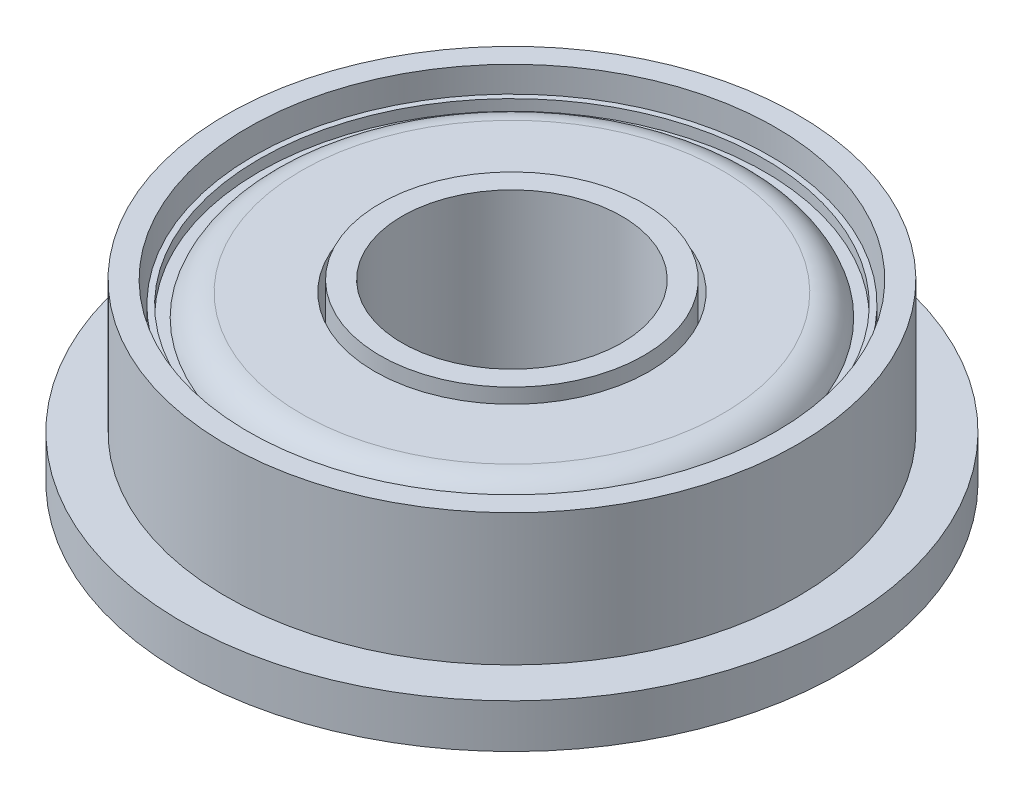
ISO-10303-21;
HEADER;
FILE_DESCRIPTION(('STEP AP214'),'2;1');
FILE_NAME('part.step','',(''),(''),'','','');
FILE_SCHEMA(('AUTOMOTIVE_DESIGN { 1 0 10303 214 1 1 1 1 }'));
ENDSEC;
DATA;
#1=APPLICATION_CONTEXT('core data for automotive mechanical design processes');
#2=APPLICATION_PROTOCOL_DEFINITION('international standard','automotive_design',2000,#1);
#3=PRODUCT_CONTEXT('',#1,'mechanical');
#4=PRODUCT('Part','Part','',(#3));
#5=PRODUCT_RELATED_PRODUCT_CATEGORY('part','',(#4));
#6=PRODUCT_DEFINITION_FORMATION('','',#4);
#7=PRODUCT_DEFINITION_CONTEXT('part definition',#1,'design');
#8=PRODUCT_DEFINITION('design','',#6,#7);
#9=PRODUCT_DEFINITION_SHAPE('','',#8);
#10=(LENGTH_UNIT() NAMED_UNIT(*) SI_UNIT(.MILLI.,.METRE.));
#11=(NAMED_UNIT(*) PLANE_ANGLE_UNIT() SI_UNIT($,.RADIAN.));
#12=(NAMED_UNIT(*) SI_UNIT($,.STERADIAN.) SOLID_ANGLE_UNIT());
#13=UNCERTAINTY_MEASURE_WITH_UNIT(LENGTH_MEASURE(1.E-05),#10,'distance_accuracy_value','');
#14=(GEOMETRIC_REPRESENTATION_CONTEXT(3) GLOBAL_UNCERTAINTY_ASSIGNED_CONTEXT((#13)) GLOBAL_UNIT_ASSIGNED_CONTEXT((#10,
#11,#12)) REPRESENTATION_CONTEXT('',''));
#15=CARTESIAN_POINT('',(0.,0.,0.));
#16=DIRECTION('',(0.,0.,1.));
#17=DIRECTION('',(1.,0.,0.));
#18=AXIS2_PLACEMENT_3D('',#15,#16,#17);
#19=CARTESIAN_POINT('',(0.,0.,0.));
#20=DIRECTION('',(0.,1.,0.));
#21=DIRECTION('',(1.,0.,0.));
#22=AXIS2_PLACEMENT_3D('',#19,#20,#21);
#23=PLANE('',#22);
#24=CARTESIAN_POINT('',(0.,0.,0.));
#25=DIRECTION('',(0.,-1.,0.));
#26=DIRECTION('',(1.,0.,0.));
#27=AXIS2_PLACEMENT_3D('',#24,#25,#26);
#28=CIRCLE('',#27,2.5);
#29=CARTESIAN_POINT('',(-2.5,0.,0.));
#30=VERTEX_POINT('',#29);
#31=EDGE_CURVE('E187',#30,#30,#28,.T.);
#32=ORIENTED_EDGE('',*,*,#31,.F.);
#33=EDGE_LOOP('',(#32));
#34=FACE_BOUND('',#33,.T.);
#35=CARTESIAN_POINT('',(0.,0.,0.));
#36=DIRECTION('',(0.,-1.,0.));
#37=DIRECTION('',(1.,0.,0.));
#38=AXIS2_PLACEMENT_3D('',#35,#36,#37);
#39=CIRCLE('',#38,3.00000004470348);
#40=CARTESIAN_POINT('',(-3.00000004470348,0.,0.));
#41=VERTEX_POINT('',#40);
#42=EDGE_CURVE('E136',#41,#41,#39,.T.);
#43=ORIENTED_EDGE('',*,*,#42,.T.);
#44=EDGE_LOOP('',(#43));
#45=FACE_BOUND('',#44,.T.);
#46=ADVANCED_FACE('F16',(#34,#45),#23,.F.);
#47=CARTESIAN_POINT('',(0.,1.,0.));
#48=DIRECTION('',(0.,1.,0.));
#49=DIRECTION('',(1.,0.,0.));
#50=AXIS2_PLACEMENT_3D('',#47,#48,#49);
#51=PLANE('',#50);
#52=CARTESIAN_POINT('',(0.,1.,0.));
#53=DIRECTION('',(0.,-1.,0.));
#54=DIRECTION('',(-1.,0.,0.));
#55=AXIS2_PLACEMENT_3D('',#52,#53,#54);
#56=CIRCLE('',#55,6.5);
#57=CARTESIAN_POINT('',(6.5,1.,0.));
#58=VERTEX_POINT('',#57);
#59=EDGE_CURVE('E168',#58,#58,#56,.T.);
#60=ORIENTED_EDGE('',*,*,#59,.T.);
#61=EDGE_LOOP('',(#60));
#62=FACE_BOUND('',#61,.T.);
#63=CARTESIAN_POINT('',(0.,1.,0.));
#64=DIRECTION('',(0.,1.,0.));
#65=DIRECTION('',(1.,0.,0.));
#66=AXIS2_PLACEMENT_3D('',#63,#64,#65);
#67=CIRCLE('',#66,7.5);
#68=CARTESIAN_POINT('',(-7.5,1.,0.));
#69=VERTEX_POINT('',#68);
#70=EDGE_CURVE('E27',#69,#69,#67,.T.);
#71=ORIENTED_EDGE('',*,*,#70,.T.);
#72=EDGE_LOOP('',(#71));
#73=FACE_BOUND('',#72,.T.);
#74=ADVANCED_FACE('F269',(#62,#73),#51,.T.);
#75=CARTESIAN_POINT('',(0.,0.,0.));
#76=DIRECTION('',(0.,1.,0.));
#77=DIRECTION('',(1.,0.,0.));
#78=AXIS2_PLACEMENT_3D('',#75,#76,#77);
#79=CYLINDRICAL_SURFACE('',#78,7.5);
#80=ORIENTED_EDGE('',*,*,#70,.F.);
#81=DIRECTION('',(0.,-1.,0.));
#82=VECTOR('',#81,1.);
#83=CARTESIAN_POINT('',(-7.5,0.,0.));
#84=LINE('',#83,#82);
#85=CARTESIAN_POINT('',(-7.5,0.,0.));
#86=VERTEX_POINT('',#85);
#87=EDGE_CURVE('E11',#69,#86,#84,.T.);
#88=ORIENTED_EDGE('',*,*,#87,.T.);
#89=CARTESIAN_POINT('',(0.,0.,0.));
#90=DIRECTION('',(0.,1.,0.));
#91=DIRECTION('',(1.,0.,0.));
#92=AXIS2_PLACEMENT_3D('',#89,#90,#91);
#93=CIRCLE('',#92,7.5);
#94=EDGE_CURVE('E163',#86,#86,#93,.T.);
#95=ORIENTED_EDGE('',*,*,#94,.T.);
#96=ORIENTED_EDGE('',*,*,#87,.F.);
#97=EDGE_LOOP('',(#80,#88,#95,#96));
#98=FACE_BOUND('',#97,.T.);
#99=ADVANCED_FACE('F18',(#98),#79,.T.);
#100=CARTESIAN_POINT('',(0.,0.,0.));
#101=DIRECTION('',(0.,1.,0.));
#102=DIRECTION('',(1.,0.,0.));
#103=AXIS2_PLACEMENT_3D('',#100,#101,#102);
#104=CYLINDRICAL_SURFACE('',#103,2.5);
#105=CARTESIAN_POINT('',(0.,4.,0.));
#106=DIRECTION('',(0.,-1.,0.));
#107=DIRECTION('',(-1.,0.,0.));
#108=AXIS2_PLACEMENT_3D('',#105,#106,#107);
#109=CIRCLE('',#108,2.5);
#110=CARTESIAN_POINT('',(2.5,4.,0.));
#111=VERTEX_POINT('',#110);
#112=CARTESIAN_POINT('',(-2.5,4.,0.));
#113=VERTEX_POINT('',#112);
#114=EDGE_CURVE('E233',#111,#113,#109,.T.);
#115=ORIENTED_EDGE('',*,*,#114,.F.);
#116=CARTESIAN_POINT('',(0.,4.,0.));
#117=DIRECTION('',(0.,-1.,0.));
#118=DIRECTION('',(-1.,0.,0.));
#119=AXIS2_PLACEMENT_3D('',#116,#117,#118);
#120=CIRCLE('',#119,2.5);
#121=EDGE_CURVE('E250',#113,#111,#120,.T.);
#122=ORIENTED_EDGE('',*,*,#121,.F.);
#123=DIRECTION('',(0.,-1.,0.));
#124=VECTOR('',#123,1.);
#125=CARTESIAN_POINT('',(-2.5,0.,0.));
#126=LINE('',#125,#124);
#127=EDGE_CURVE('E190',#113,#30,#126,.T.);
#128=ORIENTED_EDGE('',*,*,#127,.T.);
#129=ORIENTED_EDGE('',*,*,#31,.T.);
#130=ORIENTED_EDGE('',*,*,#127,.F.);
#131=EDGE_LOOP('',(#115,#122,#128,#129,#130));
#132=FACE_BOUND('',#131,.T.);
#133=ADVANCED_FACE('F265',(#132),#104,.F.);
#134=CARTESIAN_POINT('',(0.,4.,0.));
#135=DIRECTION('',(0.,1.,0.));
#136=DIRECTION('',(1.,0.,0.));
#137=AXIS2_PLACEMENT_3D('',#134,#135,#136);
#138=PLANE('',#137);
#139=ORIENTED_EDGE('',*,*,#114,.T.);
#140=ORIENTED_EDGE('',*,*,#121,.T.);
#141=EDGE_LOOP('',(#139,#140));
#142=FACE_BOUND('',#141,.T.);
#143=CARTESIAN_POINT('',(0.,4.,0.));
#144=DIRECTION('',(0.,1.,0.));
#145=DIRECTION('',(-1.,0.,0.));
#146=AXIS2_PLACEMENT_3D('',#143,#144,#145);
#147=CIRCLE('',#146,3.00000004470348);
#148=CARTESIAN_POINT('',(3.00000004470348,4.,0.));
#149=VERTEX_POINT('',#148);
#150=EDGE_CURVE('E175',#149,#149,#147,.T.);
#151=ORIENTED_EDGE('',*,*,#150,.T.);
#152=EDGE_LOOP('',(#151));
#153=FACE_BOUND('',#152,.T.);
#154=ADVANCED_FACE('F262',(#142,#153),#138,.T.);
#155=CARTESIAN_POINT('',(0.,1.,0.));
#156=DIRECTION('',(0.,1.,0.));
#157=DIRECTION('',(-1.,0.,0.));
#158=AXIS2_PLACEMENT_3D('',#155,#156,#157);
#159=CYLINDRICAL_SURFACE('',#158,6.5);
#160=CARTESIAN_POINT('',(0.,4.,0.));
#161=DIRECTION('',(0.,1.,0.));
#162=DIRECTION('',(-1.,0.,0.));
#163=AXIS2_PLACEMENT_3D('',#160,#161,#162);
#164=CIRCLE('',#163,6.5);
#165=CARTESIAN_POINT('',(6.5,4.,0.));
#166=VERTEX_POINT('',#165);
#167=EDGE_CURVE('E169',#166,#166,#164,.T.);
#168=ORIENTED_EDGE('',*,*,#167,.F.);
#169=DIRECTION('',(0.,-1.,0.));
#170=VECTOR('',#169,1.);
#171=CARTESIAN_POINT('',(6.5,1.,0.));
#172=LINE('',#171,#170);
#173=EDGE_CURVE('E164',#166,#58,#172,.T.);
#174=ORIENTED_EDGE('',*,*,#173,.T.);
#175=ORIENTED_EDGE('',*,*,#59,.F.);
#176=ORIENTED_EDGE('',*,*,#173,.F.);
#177=EDGE_LOOP('',(#168,#174,#175,#176));
#178=FACE_BOUND('',#177,.T.);
#179=ADVANCED_FACE('F288',(#178),#159,.T.);
#180=CARTESIAN_POINT('',(0.,4.,0.));
#181=DIRECTION('',(0.,1.,0.));
#182=DIRECTION('',(1.,0.,0.));
#183=AXIS2_PLACEMENT_3D('',#180,#181,#182);
#184=PLANE('',#183);
#185=CARTESIAN_POINT('',(0.,4.,0.));
#186=DIRECTION('',(0.,-1.,0.));
#187=DIRECTION('',(-1.,0.,0.));
#188=AXIS2_PLACEMENT_3D('',#185,#186,#187);
#189=CIRCLE('',#188,6.);
#190=CARTESIAN_POINT('',(6.,4.,0.));
#191=VERTEX_POINT('',#190);
#192=EDGE_CURVE('E153',#191,#191,#189,.T.);
#193=ORIENTED_EDGE('',*,*,#192,.T.);
#194=EDGE_LOOP('',(#193));
#195=FACE_BOUND('',#194,.T.);
#196=ORIENTED_EDGE('',*,*,#167,.T.);
#197=EDGE_LOOP('',(#196));
#198=FACE_BOUND('',#197,.T.);
#199=ADVANCED_FACE('F295',(#195,#198),#184,.T.);
#200=CARTESIAN_POINT('',(0.,1.,0.));
#201=DIRECTION('',(0.,1.,0.));
#202=DIRECTION('',(1.,0.,0.));
#203=AXIS2_PLACEMENT_3D('',#200,#201,#202);
#204=PLANE('',#203);
#205=CARTESIAN_POINT('',(0.,1.,0.));
#206=DIRECTION('',(0.,1.,0.));
#207=DIRECTION('',(-1.,0.,0.));
#208=AXIS2_PLACEMENT_3D('',#205,#206,#207);
#209=CIRCLE('',#208,5.875);
#210=CARTESIAN_POINT('',(5.875,1.,0.));
#211=VERTEX_POINT('',#210);
#212=EDGE_CURVE('E150',#211,#211,#209,.T.);
#213=ORIENTED_EDGE('',*,*,#212,.F.);
#214=EDGE_LOOP('',(#213));
#215=FACE_BOUND('',#214,.T.);
#216=CARTESIAN_POINT('',(0.,1.,0.));
#217=DIRECTION('',(0.,-1.,0.));
#218=DIRECTION('',(-1.,0.,0.));
#219=AXIS2_PLACEMENT_3D('',#216,#217,#218);
#220=CIRCLE('',#219,6.);
#221=CARTESIAN_POINT('',(6.,1.,0.));
#222=VERTEX_POINT('',#221);
#223=EDGE_CURVE('E20',#222,#222,#220,.T.);
#224=ORIENTED_EDGE('',*,*,#223,.F.);
#225=EDGE_LOOP('',(#224));
#226=FACE_BOUND('',#225,.T.);
#227=ADVANCED_FACE('F298',(#215,#226),#204,.T.);
#228=CARTESIAN_POINT('',(0.,4.,0.));
#229=DIRECTION('',(0.,-1.,0.));
#230=DIRECTION('',(-1.,0.,0.));
#231=AXIS2_PLACEMENT_3D('',#228,#229,#230);
#232=CYLINDRICAL_SURFACE('',#231,6.);
#233=ORIENTED_EDGE('',*,*,#192,.F.);
#234=DIRECTION('',(0.,-1.,0.));
#235=VECTOR('',#234,1.);
#236=CARTESIAN_POINT('',(6.,4.,0.));
#237=LINE('',#236,#235);
#238=EDGE_CURVE('E106',#191,#222,#237,.T.);
#239=ORIENTED_EDGE('',*,*,#238,.T.);
#240=ORIENTED_EDGE('',*,*,#223,.T.);
#241=ORIENTED_EDGE('',*,*,#238,.F.);
#242=EDGE_LOOP('',(#233,#239,#240,#241));
#243=FACE_BOUND('',#242,.T.);
#244=ADVANCED_FACE('F329',(#243),#232,.F.);
#245=CARTESIAN_POINT('',(0.,4.,0.));
#246=DIRECTION('',(0.,-1.,0.));
#247=DIRECTION('',(-1.,0.,0.));
#248=AXIS2_PLACEMENT_3D('',#245,#246,#247);
#249=CYLINDRICAL_SURFACE('',#248,5.875);
#250=CARTESIAN_POINT('',(0.,3.5,0.));
#251=DIRECTION('',(0.,-1.,0.));
#252=DIRECTION('',(-1.,0.,0.));
#253=AXIS2_PLACEMENT_3D('',#250,#251,#252);
#254=CIRCLE('',#253,5.875);
#255=CARTESIAN_POINT('',(5.875,3.5,0.));
#256=VERTEX_POINT('',#255);
#257=EDGE_CURVE('E179',#256,#256,#254,.T.);
#258=ORIENTED_EDGE('',*,*,#257,.T.);
#259=DIRECTION('',(0.,-1.,0.));
#260=VECTOR('',#259,1.);
#261=CARTESIAN_POINT('',(5.875,4.,0.));
#262=LINE('',#261,#260);
#263=EDGE_CURVE('E154',#256,#211,#262,.T.);
#264=ORIENTED_EDGE('',*,*,#263,.T.);
#265=ORIENTED_EDGE('',*,*,#212,.T.);
#266=ORIENTED_EDGE('',*,*,#263,.F.);
#267=EDGE_LOOP('',(#258,#264,#265,#266));
#268=FACE_BOUND('',#267,.T.);
#269=ADVANCED_FACE('F324',(#268),#249,.T.);
#270=CARTESIAN_POINT('',(0.,1.,0.));
#271=DIRECTION('',(0.,1.,0.));
#272=DIRECTION('',(1.,0.,0.));
#273=AXIS2_PLACEMENT_3D('',#270,#271,#272);
#274=PLANE('',#273);
#275=CARTESIAN_POINT('',(0.,1.,0.));
#276=DIRECTION('',(0.,1.,0.));
#277=DIRECTION('',(-1.,0.,0.));
#278=AXIS2_PLACEMENT_3D('',#275,#276,#277);
#279=CIRCLE('',#278,3.00000004470348);
#280=CARTESIAN_POINT('',(3.00000004470348,1.,0.));
#281=VERTEX_POINT('',#280);
#282=EDGE_CURVE('E174',#281,#281,#279,.T.);
#283=ORIENTED_EDGE('',*,*,#282,.F.);
#284=EDGE_LOOP('',(#283));
#285=FACE_BOUND('',#284,.T.);
#286=CARTESIAN_POINT('',(0.,1.,0.));
#287=DIRECTION('',(0.,-1.,0.));
#288=DIRECTION('',(-1.,0.,0.));
#289=AXIS2_PLACEMENT_3D('',#286,#287,#288);
#290=CIRCLE('',#289,3.125);
#291=CARTESIAN_POINT('',(3.125,1.,0.));
#292=VERTEX_POINT('',#291);
#293=EDGE_CURVE('E240',#292,#292,#290,.T.);
#294=ORIENTED_EDGE('',*,*,#293,.F.);
#295=EDGE_LOOP('',(#294));
#296=FACE_BOUND('',#295,.T.);
#297=ADVANCED_FACE('F279',(#285,#296),#274,.T.);
#298=CARTESIAN_POINT('',(0.,4.,0.));
#299=DIRECTION('',(0.,-1.,0.));
#300=DIRECTION('',(-1.,0.,0.));
#301=AXIS2_PLACEMENT_3D('',#298,#299,#300);
#302=CYLINDRICAL_SURFACE('',#301,3.125);
#303=CARTESIAN_POINT('',(0.,3.75,0.));
#304=DIRECTION('',(0.,1.,0.));
#305=DIRECTION('',(-1.,0.,0.));
#306=AXIS2_PLACEMENT_3D('',#303,#304,#305);
#307=CIRCLE('',#306,3.125);
#308=CARTESIAN_POINT('',(3.125,3.75,0.));
#309=VERTEX_POINT('',#308);
#310=EDGE_CURVE('E212',#309,#309,#307,.T.);
#311=ORIENTED_EDGE('',*,*,#310,.T.);
#312=DIRECTION('',(0.,-1.,0.));
#313=VECTOR('',#312,1.);
#314=CARTESIAN_POINT('',(3.125,4.,0.));
#315=LINE('',#314,#313);
#316=EDGE_CURVE('E205',#309,#292,#315,.T.);
#317=ORIENTED_EDGE('',*,*,#316,.T.);
#318=ORIENTED_EDGE('',*,*,#293,.T.);
#319=ORIENTED_EDGE('',*,*,#316,.F.);
#320=EDGE_LOOP('',(#311,#317,#318,#319));
#321=FACE_BOUND('',#320,.T.);
#322=ADVANCED_FACE('F317',(#321),#302,.F.);
#323=CARTESIAN_POINT('',(0.,4.,0.));
#324=DIRECTION('',(0.,-1.,0.));
#325=DIRECTION('',(-1.,0.,0.));
#326=AXIS2_PLACEMENT_3D('',#323,#324,#325);
#327=CYLINDRICAL_SURFACE('',#326,3.00000004470348);
#328=ORIENTED_EDGE('',*,*,#150,.F.);
#329=DIRECTION('',(0.,-1.,0.));
#330=VECTOR('',#329,1.);
#331=CARTESIAN_POINT('',(3.00000004470348,4.,0.));
#332=LINE('',#331,#330);
#333=EDGE_CURVE('E170',#149,#281,#332,.T.);
#334=ORIENTED_EDGE('',*,*,#333,.T.);
#335=ORIENTED_EDGE('',*,*,#282,.T.);
#336=ORIENTED_EDGE('',*,*,#333,.F.);
#337=EDGE_LOOP('',(#328,#334,#335,#336));
#338=FACE_BOUND('',#337,.T.);
#339=ADVANCED_FACE('F309',(#338),#327,.T.);
#340=CARTESIAN_POINT('',(0.,3.5,0.));
#341=DIRECTION('',(0.,1.,0.));
#342=DIRECTION('',(1.,0.,0.));
#343=AXIS2_PLACEMENT_3D('',#340,#341,#342);
#344=PLANE('',#343);
#345=CARTESIAN_POINT('',(0.,3.5,0.));
#346=DIRECTION('',(0.,1.,0.));
#347=DIRECTION('',(-1.,0.,0.));
#348=AXIS2_PLACEMENT_3D('',#345,#346,#347);
#349=CIRCLE('',#348,5.75);
#350=CARTESIAN_POINT('',(5.75,3.5,0.));
#351=VERTEX_POINT('',#350);
#352=EDGE_CURVE('E198',#351,#351,#349,.T.);
#353=ORIENTED_EDGE('',*,*,#352,.F.);
#354=EDGE_LOOP('',(#353));
#355=FACE_BOUND('',#354,.T.);
#356=ORIENTED_EDGE('',*,*,#257,.F.);
#357=EDGE_LOOP('',(#356));
#358=FACE_BOUND('',#357,.T.);
#359=ADVANCED_FACE('F307',(#355,#358),#344,.T.);
#360=CARTESIAN_POINT('',(0.,3.25,0.));
#361=DIRECTION('',(0.,1.,0.));
#362=DIRECTION('',(1.,0.,0.));
#363=AXIS2_PLACEMENT_3D('',#360,#361,#362);
#364=PLANE('',#363);
#365=CARTESIAN_POINT('',(0.,3.25,0.));
#366=DIRECTION('',(0.,1.,0.));
#367=DIRECTION('',(-1.,0.,0.));
#368=AXIS2_PLACEMENT_3D('',#365,#366,#367);
#369=CIRCLE('',#368,5.5);
#370=CARTESIAN_POINT('',(-5.5,3.25,0.));
#371=VERTEX_POINT('',#370);
#372=EDGE_CURVE('E202',#371,#371,#369,.T.);
#373=ORIENTED_EDGE('',*,*,#372,.F.);
#374=EDGE_LOOP('',(#373));
#375=FACE_BOUND('',#374,.T.);
#376=CARTESIAN_POINT('',(0.,3.25,0.));
#377=DIRECTION('',(0.,-1.,0.));
#378=DIRECTION('',(-1.,0.,0.));
#379=AXIS2_PLACEMENT_3D('',#376,#377,#378);
#380=CIRCLE('',#379,5.75);
#381=CARTESIAN_POINT('',(5.75,3.25,0.));
#382=VERTEX_POINT('',#381);
#383=EDGE_CURVE('E176',#382,#382,#380,.T.);
#384=ORIENTED_EDGE('',*,*,#383,.F.);
#385=EDGE_LOOP('',(#384));
#386=FACE_BOUND('',#385,.T.);
#387=ADVANCED_FACE('F305',(#375,#386),#364,.T.);
#388=CARTESIAN_POINT('',(0.,4.,0.));
#389=DIRECTION('',(0.,-1.,0.));
#390=DIRECTION('',(-1.,0.,0.));
#391=AXIS2_PLACEMENT_3D('',#388,#389,#390);
#392=CYLINDRICAL_SURFACE('',#391,5.75);
#393=ORIENTED_EDGE('',*,*,#352,.T.);
#394=DIRECTION('',(0.,-1.,0.));
#395=VECTOR('',#394,1.);
#396=CARTESIAN_POINT('',(5.75,4.,0.));
#397=LINE('',#396,#395);
#398=EDGE_CURVE('E180',#351,#382,#397,.T.);
#399=ORIENTED_EDGE('',*,*,#398,.T.);
#400=ORIENTED_EDGE('',*,*,#383,.T.);
#401=ORIENTED_EDGE('',*,*,#398,.F.);
#402=EDGE_LOOP('',(#393,#399,#400,#401));
#403=FACE_BOUND('',#402,.T.);
#404=ADVANCED_FACE('F293',(#403),#392,.F.);
#405=CARTESIAN_POINT('',(0.,3.75,0.));
#406=DIRECTION('',(0.,1.,0.));
#407=DIRECTION('',(1.,0.,0.));
#408=AXIS2_PLACEMENT_3D('',#405,#406,#407);
#409=PLANE('',#408);
#410=ORIENTED_EDGE('',*,*,#310,.F.);
#411=EDGE_LOOP('',(#410));
#412=FACE_BOUND('',#411,.T.);
#413=CARTESIAN_POINT('',(0.,3.75,0.));
#414=DIRECTION('',(0.,-1.,0.));
#415=DIRECTION('',(1.,0.,0.));
#416=AXIS2_PLACEMENT_3D('',#413,#414,#415);
#417=CIRCLE('',#416,4.79289321881345);
#418=CARTESIAN_POINT('',(-4.79289321881345,3.75,0.));
#419=VERTEX_POINT('',#418);
#420=EDGE_CURVE('E186',#419,#419,#417,.T.);
#421=ORIENTED_EDGE('',*,*,#420,.F.);
#422=EDGE_LOOP('',(#421));
#423=FACE_BOUND('',#422,.T.);
#424=ADVANCED_FACE('F289',(#412,#423),#409,.T.);
#425=CARTESIAN_POINT('',(0.,3.,0.));
#426=DIRECTION('',(0.,1.,0.));
#427=DIRECTION('',(1.,0.,0.));
#428=AXIS2_PLACEMENT_3D('',#425,#426,#427);
#429=TOROIDAL_SURFACE('',#428,4.79289321881345,0.75);
#430=ORIENTED_EDGE('',*,*,#420,.T.);
#431=CARTESIAN_POINT('',(-4.79289321881345,3.,0.));
#432=DIRECTION('',(0.,0.,1.));
#433=DIRECTION('',(-1.,0.,0.));
#434=AXIS2_PLACEMENT_3D('',#431,#432,#433);
#435=CIRCLE('',#434,0.75);
#436=EDGE_CURVE('E194',#419,#371,#435,.T.);
#437=ORIENTED_EDGE('',*,*,#436,.T.);
#438=ORIENTED_EDGE('',*,*,#372,.T.);
#439=ORIENTED_EDGE('',*,*,#436,.F.);
#440=EDGE_LOOP('',(#430,#437,#438,#439));
#441=FACE_BOUND('',#440,.T.);
#442=ADVANCED_FACE('F292',(#441),#429,.T.);
#443=CARTESIAN_POINT('',(0.,0.,0.));
#444=DIRECTION('',(0.,1.,0.));
#445=DIRECTION('',(1.,0.,0.));
#446=AXIS2_PLACEMENT_3D('',#443,#444,#445);
#447=PLANE('',#446);
#448=CARTESIAN_POINT('',(0.,0.,0.));
#449=DIRECTION('',(0.,1.,0.));
#450=DIRECTION('',(1.,0.,0.));
#451=AXIS2_PLACEMENT_3D('',#448,#449,#450);
#452=CIRCLE('',#451,6.);
#453=CARTESIAN_POINT('',(-6.,0.,0.));
#454=VERTEX_POINT('',#453);
#455=EDGE_CURVE('E160',#454,#454,#452,.T.);
#456=ORIENTED_EDGE('',*,*,#455,.T.);
#457=EDGE_LOOP('',(#456));
#458=FACE_BOUND('',#457,.T.);
#459=ORIENTED_EDGE('',*,*,#94,.F.);
#460=EDGE_LOOP('',(#459));
#461=FACE_BOUND('',#460,.T.);
#462=ADVANCED_FACE('F302',(#458,#461),#447,.F.);
#463=CARTESIAN_POINT('',(0.,0.25,0.));
#464=DIRECTION('',(0.,-1.,0.));
#465=DIRECTION('',(0.,0.,-1.));
#466=AXIS2_PLACEMENT_3D('',#463,#464,#465);
#467=PLANE('',#466);
#468=CARTESIAN_POINT('',(0.,0.25,0.));
#469=DIRECTION('',(0.,-1.,0.));
#470=DIRECTION('',(1.,0.,0.));
#471=AXIS2_PLACEMENT_3D('',#468,#469,#470);
#472=CIRCLE('',#471,3.00000004470348);
#473=CARTESIAN_POINT('',(-3.00000004470348,0.25,0.));
#474=VERTEX_POINT('',#473);
#475=EDGE_CURVE('E138',#474,#474,#472,.T.);
#476=ORIENTED_EDGE('',*,*,#475,.F.);
#477=EDGE_LOOP('',(#476));
#478=FACE_BOUND('',#477,.T.);
#479=CARTESIAN_POINT('',(0.,0.25,0.));
#480=DIRECTION('',(0.,1.,0.));
#481=DIRECTION('',(1.,0.,0.));
#482=AXIS2_PLACEMENT_3D('',#479,#480,#481);
#483=CIRCLE('',#482,6.);
#484=CARTESIAN_POINT('',(-6.,0.25,0.));
#485=VERTEX_POINT('',#484);
#486=EDGE_CURVE('E159',#485,#485,#483,.T.);
#487=ORIENTED_EDGE('',*,*,#486,.F.);
#488=EDGE_LOOP('',(#487));
#489=FACE_BOUND('',#488,.T.);
#490=ADVANCED_FACE('F284',(#478,#489),#467,.T.);
#491=CARTESIAN_POINT('',(0.,0.,0.));
#492=DIRECTION('',(0.,1.,0.));
#493=DIRECTION('',(1.,0.,0.));
#494=AXIS2_PLACEMENT_3D('',#491,#492,#493);
#495=CYLINDRICAL_SURFACE('',#494,6.);
#496=ORIENTED_EDGE('',*,*,#455,.F.);
#497=DIRECTION('',(0.,1.,0.));
#498=VECTOR('',#497,1.);
#499=CARTESIAN_POINT('',(-6.,0.,0.));
#500=LINE('',#499,#498);
#501=EDGE_CURVE('E155',#454,#485,#500,.T.);
#502=ORIENTED_EDGE('',*,*,#501,.T.);
#503=ORIENTED_EDGE('',*,*,#486,.T.);
#504=ORIENTED_EDGE('',*,*,#501,.F.);
#505=EDGE_LOOP('',(#496,#502,#503,#504));
#506=FACE_BOUND('',#505,.T.);
#507=ADVANCED_FACE('F281',(#506),#495,.F.);
#508=CARTESIAN_POINT('',(0.,0.,0.));
#509=DIRECTION('',(0.,1.,0.));
#510=DIRECTION('',(1.,0.,0.));
#511=AXIS2_PLACEMENT_3D('',#508,#509,#510);
#512=CYLINDRICAL_SURFACE('',#511,3.00000004470348);
#513=ORIENTED_EDGE('',*,*,#42,.F.);
#514=DIRECTION('',(0.,1.,0.));
#515=VECTOR('',#514,1.);
#516=CARTESIAN_POINT('',(-3.00000004470348,0.,0.));
#517=LINE('',#516,#515);
#518=EDGE_CURVE('E133',#41,#474,#517,.T.);
#519=ORIENTED_EDGE('',*,*,#518,.T.);
#520=ORIENTED_EDGE('',*,*,#475,.T.);
#521=ORIENTED_EDGE('',*,*,#518,.F.);
#522=EDGE_LOOP('',(#513,#519,#520,#521));
#523=FACE_BOUND('',#522,.T.);
#524=ADVANCED_FACE('F135',(#523),#512,.T.);
#525=CLOSED_SHELL('',(#46,#74,#99,#133,#154,#179,#199,#227,#244,#269,#297,#322,#339,#359,#387,
#404,#424,#442,#462,#490,#507,#524));
#526=MANIFOLD_SOLID_BREP('B1',#525);
#527=ADVANCED_BREP_SHAPE_REPRESENTATION('',(#18,#526),#14);
#528=SHAPE_DEFINITION_REPRESENTATION(#9,#527);
ENDSEC;
END-ISO-10303-21;
